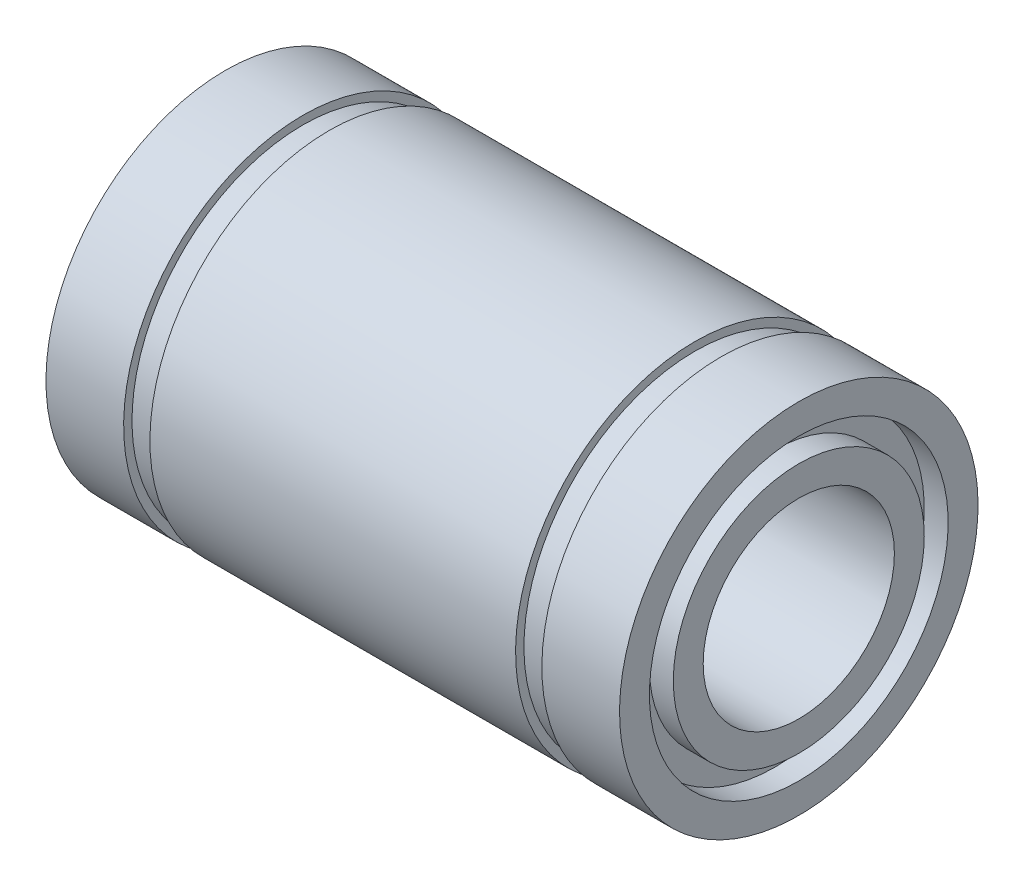
ISO-10303-21;
HEADER;
FILE_DESCRIPTION(('STEP AP214'),'2;1');
FILE_NAME('part.step','',(''),(''),'','','');
FILE_SCHEMA(('AUTOMOTIVE_DESIGN { 1 0 10303 214 1 1 1 1 }'));
ENDSEC;
DATA;
#1=APPLICATION_CONTEXT('core data for automotive mechanical design processes');
#2=APPLICATION_PROTOCOL_DEFINITION('international standard','automotive_design',2000,#1);
#3=PRODUCT_CONTEXT('',#1,'mechanical');
#4=PRODUCT('Part','Part','',(#3));
#5=PRODUCT_RELATED_PRODUCT_CATEGORY('part','',(#4));
#6=PRODUCT_DEFINITION_FORMATION('','',#4);
#7=PRODUCT_DEFINITION_CONTEXT('part definition',#1,'design');
#8=PRODUCT_DEFINITION('design','',#6,#7);
#9=PRODUCT_DEFINITION_SHAPE('','',#8);
#10=(LENGTH_UNIT() NAMED_UNIT(*) SI_UNIT(.MILLI.,.METRE.));
#11=(NAMED_UNIT(*) PLANE_ANGLE_UNIT() SI_UNIT($,.RADIAN.));
#12=(NAMED_UNIT(*) SI_UNIT($,.STERADIAN.) SOLID_ANGLE_UNIT());
#13=UNCERTAINTY_MEASURE_WITH_UNIT(LENGTH_MEASURE(1.E-05),#10,'distance_accuracy_value','');
#14=(GEOMETRIC_REPRESENTATION_CONTEXT(3) GLOBAL_UNCERTAINTY_ASSIGNED_CONTEXT((#13)) GLOBAL_UNIT_ASSIGNED_CONTEXT((#10,
#11,#12)) REPRESENTATION_CONTEXT('',''));
#15=CARTESIAN_POINT('',(0.,0.,0.));
#16=DIRECTION('',(0.,0.,1.));
#17=DIRECTION('',(1.,0.,0.));
#18=AXIS2_PLACEMENT_3D('',#15,#16,#17);
#19=CARTESIAN_POINT('',(-12.,6.25,0.));
#20=DIRECTION('',(-1.,0.,0.));
#21=DIRECTION('',(0.,-1.,0.));
#22=AXIS2_PLACEMENT_3D('',#19,#20,#21);
#23=PLANE('',#22);
#24=CARTESIAN_POINT('',(-12.,0.,0.));
#25=DIRECTION('',(1.,0.,0.));
#26=DIRECTION('',(0.,1.,0.));
#27=AXIS2_PLACEMENT_3D('',#24,#25,#26);
#28=CIRCLE('',#27,6.25);
#29=CARTESIAN_POINT('',(-12.,6.25,0.));
#30=VERTEX_POINT('',#29);
#31=EDGE_CURVE('E121',#30,#30,#28,.T.);
#32=ORIENTED_EDGE('',*,*,#31,.T.);
#33=EDGE_LOOP('',(#32));
#34=FACE_BOUND('',#33,.T.);
#35=CARTESIAN_POINT('',(-12.,0.,0.));
#36=DIRECTION('',(1.,0.,0.));
#37=DIRECTION('',(0.,1.,0.));
#38=AXIS2_PLACEMENT_3D('',#35,#36,#37);
#39=CIRCLE('',#38,7.5);
#40=CARTESIAN_POINT('',(-12.,7.5,0.));
#41=VERTEX_POINT('',#40);
#42=EDGE_CURVE('E10',#41,#41,#39,.T.);
#43=ORIENTED_EDGE('',*,*,#42,.F.);
#44=EDGE_LOOP('',(#43));
#45=FACE_BOUND('',#44,.T.);
#46=ADVANCED_FACE('F38',(#34,#45),#23,.T.);
#47=CARTESIAN_POINT('',(0.,0.,0.));
#48=DIRECTION('',(1.,0.,0.));
#49=DIRECTION('',(0.,1.,0.));
#50=AXIS2_PLACEMENT_3D('',#47,#48,#49);
#51=CYLINDRICAL_SURFACE('',#50,7.50000000000001);
#52=ORIENTED_EDGE('',*,*,#42,.T.);
#53=EDGE_LOOP('',(#52));
#54=FACE_BOUND('',#53,.T.);
#55=CARTESIAN_POINT('',(-8.75,0.,0.));
#56=DIRECTION('',(1.,0.,0.));
#57=DIRECTION('',(0.,1.,0.));
#58=AXIS2_PLACEMENT_3D('',#55,#56,#57);
#59=CIRCLE('',#58,7.50000000000001);
#60=CARTESIAN_POINT('',(-8.75,7.50000000000001,0.));
#61=VERTEX_POINT('',#60);
#62=EDGE_CURVE('E45',#61,#61,#59,.T.);
#63=ORIENTED_EDGE('',*,*,#62,.F.);
#64=EDGE_LOOP('',(#63));
#65=FACE_BOUND('',#64,.T.);
#66=ADVANCED_FACE('F140',(#54,#65),#51,.T.);
#67=CARTESIAN_POINT('',(-8.75,7.50000000000001,0.));
#68=DIRECTION('',(1.,0.,0.));
#69=DIRECTION('',(0.,1.,0.));
#70=AXIS2_PLACEMENT_3D('',#67,#68,#69);
#71=PLANE('',#70);
#72=ORIENTED_EDGE('',*,*,#62,.T.);
#73=EDGE_LOOP('',(#72));
#74=FACE_BOUND('',#73,.T.);
#75=CARTESIAN_POINT('',(-8.75,0.,0.));
#76=DIRECTION('',(1.,0.,0.));
#77=DIRECTION('',(0.,1.,0.));
#78=AXIS2_PLACEMENT_3D('',#75,#76,#77);
#79=CIRCLE('',#78,7.15);
#80=CARTESIAN_POINT('',(-8.75,7.15,0.));
#81=VERTEX_POINT('',#80);
#82=EDGE_CURVE('E52',#81,#81,#79,.T.);
#83=ORIENTED_EDGE('',*,*,#82,.F.);
#84=EDGE_LOOP('',(#83));
#85=FACE_BOUND('',#84,.T.);
#86=ADVANCED_FACE('F144',(#74,#85),#71,.T.);
#87=CARTESIAN_POINT('',(0.,0.,0.));
#88=DIRECTION('',(1.,0.,0.));
#89=DIRECTION('',(0.,1.,0.));
#90=AXIS2_PLACEMENT_3D('',#87,#88,#89);
#91=CYLINDRICAL_SURFACE('',#90,7.15);
#92=ORIENTED_EDGE('',*,*,#82,.T.);
#93=EDGE_LOOP('',(#92));
#94=FACE_BOUND('',#93,.T.);
#95=CARTESIAN_POINT('',(-7.65,0.,0.));
#96=DIRECTION('',(1.,0.,0.));
#97=DIRECTION('',(0.,1.,0.));
#98=AXIS2_PLACEMENT_3D('',#95,#96,#97);
#99=CIRCLE('',#98,7.15);
#100=CARTESIAN_POINT('',(-7.65,7.15,0.));
#101=VERTEX_POINT('',#100);
#102=EDGE_CURVE('E59',#101,#101,#99,.T.);
#103=ORIENTED_EDGE('',*,*,#102,.F.);
#104=EDGE_LOOP('',(#103));
#105=FACE_BOUND('',#104,.T.);
#106=ADVANCED_FACE('F148',(#94,#105),#91,.T.);
#107=CARTESIAN_POINT('',(-7.65,7.15,0.));
#108=DIRECTION('',(-1.,0.,0.));
#109=DIRECTION('',(0.,-1.,0.));
#110=AXIS2_PLACEMENT_3D('',#107,#108,#109);
#111=PLANE('',#110);
#112=ORIENTED_EDGE('',*,*,#102,.T.);
#113=EDGE_LOOP('',(#112));
#114=FACE_BOUND('',#113,.T.);
#115=CARTESIAN_POINT('',(-7.65,0.,0.));
#116=DIRECTION('',(1.,0.,0.));
#117=DIRECTION('',(0.,1.,0.));
#118=AXIS2_PLACEMENT_3D('',#115,#116,#117);
#119=CIRCLE('',#118,7.50000000000001);
#120=CARTESIAN_POINT('',(-7.65,7.50000000000001,0.));
#121=VERTEX_POINT('',#120);
#122=EDGE_CURVE('E64',#121,#121,#119,.T.);
#123=ORIENTED_EDGE('',*,*,#122,.F.);
#124=EDGE_LOOP('',(#123));
#125=FACE_BOUND('',#124,.T.);
#126=ADVANCED_FACE('F154',(#114,#125),#111,.T.);
#127=CARTESIAN_POINT('',(0.,0.,0.));
#128=DIRECTION('',(1.,0.,0.));
#129=DIRECTION('',(0.,1.,0.));
#130=AXIS2_PLACEMENT_3D('',#127,#128,#129);
#131=CYLINDRICAL_SURFACE('',#130,7.50000000000001);
#132=ORIENTED_EDGE('',*,*,#122,.T.);
#133=EDGE_LOOP('',(#132));
#134=FACE_BOUND('',#133,.T.);
#135=CARTESIAN_POINT('',(7.65,0.,0.));
#136=DIRECTION('',(1.,0.,0.));
#137=DIRECTION('',(0.,1.,0.));
#138=AXIS2_PLACEMENT_3D('',#135,#136,#137);
#139=CIRCLE('',#138,7.50000000000001);
#140=CARTESIAN_POINT('',(7.65,7.50000000000001,0.));
#141=VERTEX_POINT('',#140);
#142=EDGE_CURVE('E68',#141,#141,#139,.T.);
#143=ORIENTED_EDGE('',*,*,#142,.F.);
#144=EDGE_LOOP('',(#143));
#145=FACE_BOUND('',#144,.T.);
#146=ADVANCED_FACE('F158',(#134,#145),#131,.T.);
#147=CARTESIAN_POINT('',(7.65,7.50000000000001,0.));
#148=DIRECTION('',(1.,0.,0.));
#149=DIRECTION('',(0.,1.,0.));
#150=AXIS2_PLACEMENT_3D('',#147,#148,#149);
#151=PLANE('',#150);
#152=ORIENTED_EDGE('',*,*,#142,.T.);
#153=EDGE_LOOP('',(#152));
#154=FACE_BOUND('',#153,.T.);
#155=CARTESIAN_POINT('',(7.65,0.,0.));
#156=DIRECTION('',(1.,0.,0.));
#157=DIRECTION('',(0.,1.,0.));
#158=AXIS2_PLACEMENT_3D('',#155,#156,#157);
#159=CIRCLE('',#158,7.15);
#160=CARTESIAN_POINT('',(7.65,7.15,0.));
#161=VERTEX_POINT('',#160);
#162=EDGE_CURVE('E72',#161,#161,#159,.T.);
#163=ORIENTED_EDGE('',*,*,#162,.F.);
#164=EDGE_LOOP('',(#163));
#165=FACE_BOUND('',#164,.T.);
#166=ADVANCED_FACE('F162',(#154,#165),#151,.T.);
#167=CARTESIAN_POINT('',(0.,0.,0.));
#168=DIRECTION('',(1.,0.,0.));
#169=DIRECTION('',(0.,1.,0.));
#170=AXIS2_PLACEMENT_3D('',#167,#168,#169);
#171=CYLINDRICAL_SURFACE('',#170,7.15);
#172=ORIENTED_EDGE('',*,*,#162,.T.);
#173=EDGE_LOOP('',(#172));
#174=FACE_BOUND('',#173,.T.);
#175=CARTESIAN_POINT('',(8.75000000000001,0.,0.));
#176=DIRECTION('',(1.,0.,0.));
#177=DIRECTION('',(0.,1.,0.));
#178=AXIS2_PLACEMENT_3D('',#175,#176,#177);
#179=CIRCLE('',#178,7.15);
#180=CARTESIAN_POINT('',(8.75000000000001,7.15,0.));
#181=VERTEX_POINT('',#180);
#182=EDGE_CURVE('E76',#181,#181,#179,.T.);
#183=ORIENTED_EDGE('',*,*,#182,.F.);
#184=EDGE_LOOP('',(#183));
#185=FACE_BOUND('',#184,.T.);
#186=ADVANCED_FACE('F166',(#174,#185),#171,.T.);
#187=CARTESIAN_POINT('',(8.75000000000001,7.15,0.));
#188=DIRECTION('',(-1.,0.,0.));
#189=DIRECTION('',(0.,-1.,0.));
#190=AXIS2_PLACEMENT_3D('',#187,#188,#189);
#191=PLANE('',#190);
#192=ORIENTED_EDGE('',*,*,#182,.T.);
#193=EDGE_LOOP('',(#192));
#194=FACE_BOUND('',#193,.T.);
#195=CARTESIAN_POINT('',(8.75000000000001,0.,0.));
#196=DIRECTION('',(1.,0.,0.));
#197=DIRECTION('',(0.,1.,0.));
#198=AXIS2_PLACEMENT_3D('',#195,#196,#197);
#199=CIRCLE('',#198,7.50000000000001);
#200=CARTESIAN_POINT('',(8.75000000000001,7.50000000000001,0.));
#201=VERTEX_POINT('',#200);
#202=EDGE_CURVE('E80',#201,#201,#199,.T.);
#203=ORIENTED_EDGE('',*,*,#202,.F.);
#204=EDGE_LOOP('',(#203));
#205=FACE_BOUND('',#204,.T.);
#206=ADVANCED_FACE('F170',(#194,#205),#191,.T.);
#207=CARTESIAN_POINT('',(0.,0.,0.));
#208=DIRECTION('',(1.,0.,0.));
#209=DIRECTION('',(0.,1.,0.));
#210=AXIS2_PLACEMENT_3D('',#207,#208,#209);
#211=CYLINDRICAL_SURFACE('',#210,7.49999999999998);
#212=ORIENTED_EDGE('',*,*,#202,.T.);
#213=EDGE_LOOP('',(#212));
#214=FACE_BOUND('',#213,.T.);
#215=CARTESIAN_POINT('',(12.,0.,0.));
#216=DIRECTION('',(1.,0.,0.));
#217=DIRECTION('',(0.,1.,0.));
#218=AXIS2_PLACEMENT_3D('',#215,#216,#217);
#219=CIRCLE('',#218,7.49999999999995);
#220=CARTESIAN_POINT('',(12.,7.49999999999995,0.));
#221=VERTEX_POINT('',#220);
#222=EDGE_CURVE('E84',#221,#221,#219,.T.);
#223=ORIENTED_EDGE('',*,*,#222,.F.);
#224=EDGE_LOOP('',(#223));
#225=FACE_BOUND('',#224,.T.);
#226=ADVANCED_FACE('F174',(#214,#225),#211,.T.);
#227=CARTESIAN_POINT('',(12.,7.49999999999995,0.));
#228=DIRECTION('',(1.,0.,0.));
#229=DIRECTION('',(0.,1.,0.));
#230=AXIS2_PLACEMENT_3D('',#227,#228,#229);
#231=PLANE('',#230);
#232=ORIENTED_EDGE('',*,*,#222,.T.);
#233=EDGE_LOOP('',(#232));
#234=FACE_BOUND('',#233,.T.);
#235=CARTESIAN_POINT('',(12.0000000000001,0.,0.));
#236=DIRECTION('',(1.,0.,0.));
#237=DIRECTION('',(0.,1.,0.));
#238=AXIS2_PLACEMENT_3D('',#235,#236,#237);
#239=CIRCLE('',#238,6.24999999999998);
#240=CARTESIAN_POINT('',(12.0000000000001,6.24999999999998,0.));
#241=VERTEX_POINT('',#240);
#242=EDGE_CURVE('E88',#241,#241,#239,.T.);
#243=ORIENTED_EDGE('',*,*,#242,.F.);
#244=EDGE_LOOP('',(#243));
#245=FACE_BOUND('',#244,.T.);
#246=ADVANCED_FACE('F178',(#234,#245),#231,.T.);
#247=CARTESIAN_POINT('',(0.,0.,0.));
#248=DIRECTION('',(1.,0.,0.));
#249=DIRECTION('',(0.,1.,0.));
#250=AXIS2_PLACEMENT_3D('',#247,#248,#249);
#251=CYLINDRICAL_SURFACE('',#250,6.24999999999997);
#252=ORIENTED_EDGE('',*,*,#242,.T.);
#253=EDGE_LOOP('',(#252));
#254=FACE_BOUND('',#253,.T.);
#255=CARTESIAN_POINT('',(11.0000000000001,0.,0.));
#256=DIRECTION('',(1.,0.,0.));
#257=DIRECTION('',(0.,1.,0.));
#258=AXIS2_PLACEMENT_3D('',#255,#256,#257);
#259=CIRCLE('',#258,6.24999999999997);
#260=CARTESIAN_POINT('',(11.0000000000001,6.24999999999997,0.));
#261=VERTEX_POINT('',#260);
#262=EDGE_CURVE('E92',#261,#261,#259,.T.);
#263=ORIENTED_EDGE('',*,*,#262,.F.);
#264=EDGE_LOOP('',(#263));
#265=FACE_BOUND('',#264,.T.);
#266=ADVANCED_FACE('F182',(#254,#265),#251,.F.);
#267=CARTESIAN_POINT('',(11.0000000000001,6.24999999999997,0.));
#268=DIRECTION('',(1.,0.,0.));
#269=DIRECTION('',(0.,1.,0.));
#270=AXIS2_PLACEMENT_3D('',#267,#268,#269);
#271=PLANE('',#270);
#272=ORIENTED_EDGE('',*,*,#262,.T.);
#273=EDGE_LOOP('',(#272));
#274=FACE_BOUND('',#273,.T.);
#275=CARTESIAN_POINT('',(11.0000000000001,0.,0.));
#276=DIRECTION('',(1.,0.,0.));
#277=DIRECTION('',(0.,1.,0.));
#278=AXIS2_PLACEMENT_3D('',#275,#276,#277);
#279=CIRCLE('',#278,5.24999999999997);
#280=CARTESIAN_POINT('',(11.0000000000001,5.24999999999997,0.));
#281=VERTEX_POINT('',#280);
#282=EDGE_CURVE('E96',#281,#281,#279,.T.);
#283=ORIENTED_EDGE('',*,*,#282,.F.);
#284=EDGE_LOOP('',(#283));
#285=FACE_BOUND('',#284,.T.);
#286=ADVANCED_FACE('F186',(#274,#285),#271,.T.);
#287=CARTESIAN_POINT('',(0.,0.,0.));
#288=DIRECTION('',(1.,0.,0.));
#289=DIRECTION('',(0.,1.,0.));
#290=AXIS2_PLACEMENT_3D('',#287,#288,#289);
#291=CYLINDRICAL_SURFACE('',#290,5.24999999999997);
#292=ORIENTED_EDGE('',*,*,#282,.T.);
#293=EDGE_LOOP('',(#292));
#294=FACE_BOUND('',#293,.T.);
#295=CARTESIAN_POINT('',(12.0000000000001,0.,0.));
#296=DIRECTION('',(1.,0.,0.));
#297=DIRECTION('',(0.,1.,0.));
#298=AXIS2_PLACEMENT_3D('',#295,#296,#297);
#299=CIRCLE('',#298,5.24999999999998);
#300=CARTESIAN_POINT('',(12.0000000000001,5.24999999999998,0.));
#301=VERTEX_POINT('',#300);
#302=EDGE_CURVE('E100',#301,#301,#299,.T.);
#303=ORIENTED_EDGE('',*,*,#302,.F.);
#304=EDGE_LOOP('',(#303));
#305=FACE_BOUND('',#304,.T.);
#306=ADVANCED_FACE('F190',(#294,#305),#291,.T.);
#307=CARTESIAN_POINT('',(12.0000000000001,5.24999999999998,0.));
#308=DIRECTION('',(1.,0.,0.));
#309=DIRECTION('',(0.,1.,0.));
#310=AXIS2_PLACEMENT_3D('',#307,#308,#309);
#311=PLANE('',#310);
#312=ORIENTED_EDGE('',*,*,#302,.T.);
#313=EDGE_LOOP('',(#312));
#314=FACE_BOUND('',#313,.T.);
#315=CARTESIAN_POINT('',(12.0000000000001,0.,0.));
#316=DIRECTION('',(1.,0.,0.));
#317=DIRECTION('',(0.,1.,0.));
#318=AXIS2_PLACEMENT_3D('',#315,#316,#317);
#319=CIRCLE('',#318,3.99999999999999);
#320=CARTESIAN_POINT('',(12.0000000000001,4.,0.));
#321=VERTEX_POINT('',#320);
#322=EDGE_CURVE('E104',#321,#321,#319,.T.);
#323=ORIENTED_EDGE('',*,*,#322,.F.);
#324=EDGE_LOOP('',(#323));
#325=FACE_BOUND('',#324,.T.);
#326=ADVANCED_FACE('F194',(#314,#325),#311,.T.);
#327=CARTESIAN_POINT('',(0.,0.,0.));
#328=DIRECTION('',(1.,0.,0.));
#329=DIRECTION('',(0.,1.,0.));
#330=AXIS2_PLACEMENT_3D('',#327,#328,#329);
#331=CYLINDRICAL_SURFACE('',#330,4.);
#332=ORIENTED_EDGE('',*,*,#322,.T.);
#333=EDGE_LOOP('',(#332));
#334=FACE_BOUND('',#333,.T.);
#335=CARTESIAN_POINT('',(-12.,0.,0.));
#336=DIRECTION('',(1.,0.,0.));
#337=DIRECTION('',(0.,1.,0.));
#338=AXIS2_PLACEMENT_3D('',#335,#336,#337);
#339=CIRCLE('',#338,4.);
#340=CARTESIAN_POINT('',(-12.,4.,0.));
#341=VERTEX_POINT('',#340);
#342=EDGE_CURVE('E108',#341,#341,#339,.T.);
#343=ORIENTED_EDGE('',*,*,#342,.F.);
#344=EDGE_LOOP('',(#343));
#345=FACE_BOUND('',#344,.T.);
#346=ADVANCED_FACE('F198',(#334,#345),#331,.F.);
#347=CARTESIAN_POINT('',(-12.,4.,0.));
#348=DIRECTION('',(-1.,0.,0.));
#349=DIRECTION('',(0.,-1.,0.));
#350=AXIS2_PLACEMENT_3D('',#347,#348,#349);
#351=PLANE('',#350);
#352=ORIENTED_EDGE('',*,*,#342,.T.);
#353=EDGE_LOOP('',(#352));
#354=FACE_BOUND('',#353,.T.);
#355=CARTESIAN_POINT('',(-12.,0.,0.));
#356=DIRECTION('',(1.,0.,0.));
#357=DIRECTION('',(0.,1.,0.));
#358=AXIS2_PLACEMENT_3D('',#355,#356,#357);
#359=CIRCLE('',#358,5.25);
#360=CARTESIAN_POINT('',(-12.,5.25,0.));
#361=VERTEX_POINT('',#360);
#362=EDGE_CURVE('E111',#361,#361,#359,.T.);
#363=ORIENTED_EDGE('',*,*,#362,.F.);
#364=EDGE_LOOP('',(#363));
#365=FACE_BOUND('',#364,.T.);
#366=ADVANCED_FACE('F202',(#354,#365),#351,.T.);
#367=CARTESIAN_POINT('',(0.,0.,0.));
#368=DIRECTION('',(1.,0.,0.));
#369=DIRECTION('',(0.,1.,0.));
#370=AXIS2_PLACEMENT_3D('',#367,#368,#369);
#371=CYLINDRICAL_SURFACE('',#370,5.25);
#372=ORIENTED_EDGE('',*,*,#362,.T.);
#373=EDGE_LOOP('',(#372));
#374=FACE_BOUND('',#373,.T.);
#375=CARTESIAN_POINT('',(-11.,0.,0.));
#376=DIRECTION('',(1.,0.,0.));
#377=DIRECTION('',(0.,1.,0.));
#378=AXIS2_PLACEMENT_3D('',#375,#376,#377);
#379=CIRCLE('',#378,5.25);
#380=CARTESIAN_POINT('',(-11.,5.25,0.));
#381=VERTEX_POINT('',#380);
#382=EDGE_CURVE('E115',#381,#381,#379,.T.);
#383=ORIENTED_EDGE('',*,*,#382,.F.);
#384=EDGE_LOOP('',(#383));
#385=FACE_BOUND('',#384,.T.);
#386=ADVANCED_FACE('F136',(#374,#385),#371,.T.);
#387=CARTESIAN_POINT('',(-11.,6.25,0.));
#388=DIRECTION('',(-1.,0.,0.));
#389=DIRECTION('',(0.,-1.,0.));
#390=AXIS2_PLACEMENT_3D('',#387,#388,#389);
#391=PLANE('',#390);
#392=ORIENTED_EDGE('',*,*,#382,.T.);
#393=EDGE_LOOP('',(#392));
#394=FACE_BOUND('',#393,.T.);
#395=CARTESIAN_POINT('',(-11.,0.,0.));
#396=DIRECTION('',(1.,0.,0.));
#397=DIRECTION('',(0.,1.,0.));
#398=AXIS2_PLACEMENT_3D('',#395,#396,#397);
#399=CIRCLE('',#398,6.25);
#400=CARTESIAN_POINT('',(-11.,6.25,0.));
#401=VERTEX_POINT('',#400);
#402=EDGE_CURVE('E118',#401,#401,#399,.T.);
#403=ORIENTED_EDGE('',*,*,#402,.F.);
#404=EDGE_LOOP('',(#403));
#405=FACE_BOUND('',#404,.T.);
#406=ADVANCED_FACE('F130',(#394,#405),#391,.T.);
#407=CARTESIAN_POINT('',(0.,0.,0.));
#408=DIRECTION('',(1.,0.,0.));
#409=DIRECTION('',(0.,1.,0.));
#410=AXIS2_PLACEMENT_3D('',#407,#408,#409);
#411=CYLINDRICAL_SURFACE('',#410,6.25);
#412=ORIENTED_EDGE('',*,*,#402,.T.);
#413=EDGE_LOOP('',(#412));
#414=FACE_BOUND('',#413,.T.);
#415=ORIENTED_EDGE('',*,*,#31,.F.);
#416=EDGE_LOOP('',(#415));
#417=FACE_BOUND('',#416,.T.);
#418=ADVANCED_FACE('F128',(#414,#417),#411,.F.);
#419=CLOSED_SHELL('',(#46,#66,#86,#106,#126,#146,#166,#186,#206,#226,#246,#266,#286,#306,#326,
#346,#366,#386,#406,#418));
#420=MANIFOLD_SOLID_BREP('B2',#419);
#421=ADVANCED_BREP_SHAPE_REPRESENTATION('',(#18,#420),#14);
#422=SHAPE_DEFINITION_REPRESENTATION(#9,#421);
ENDSEC;
END-ISO-10303-21;
